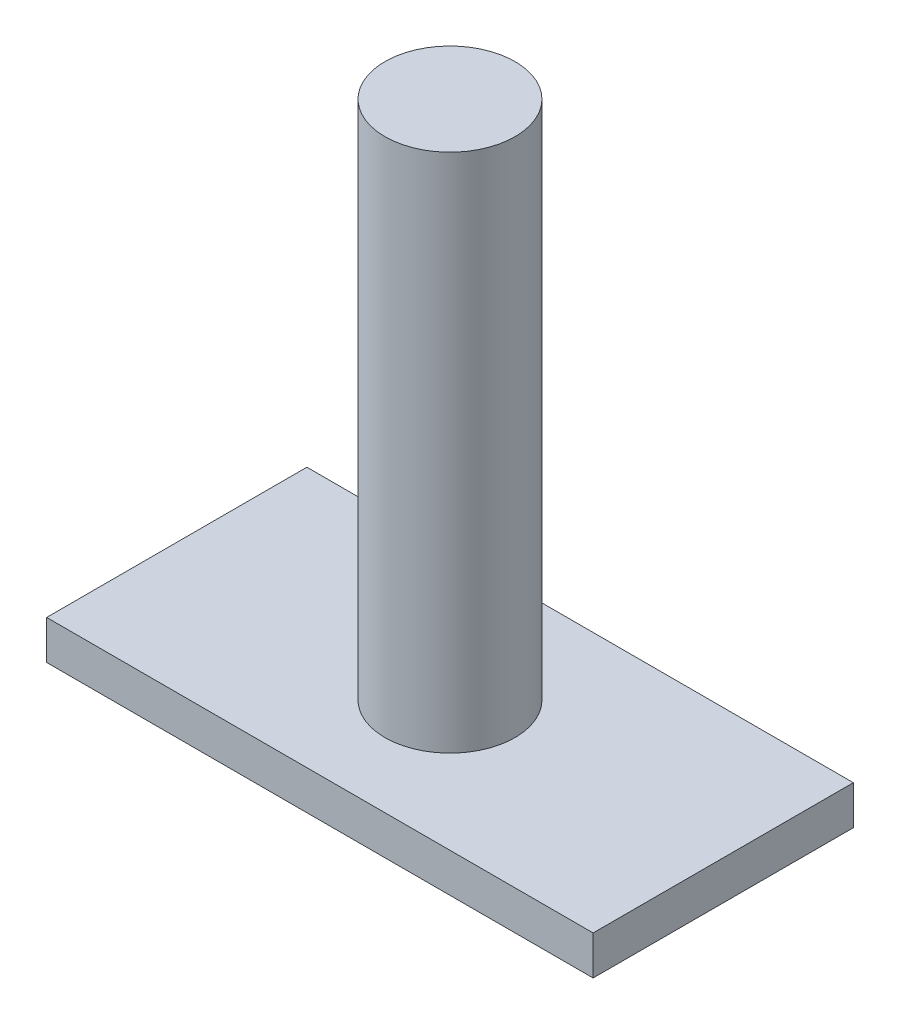
ISO-10303-21;
HEADER;
FILE_DESCRIPTION(('STEP AP214'),'2;1');
FILE_NAME('part.step','',(''),(''),'','','');
FILE_SCHEMA(('AUTOMOTIVE_DESIGN { 1 0 10303 214 1 1 1 1 }'));
ENDSEC;
DATA;
#1=APPLICATION_CONTEXT('core data for automotive mechanical design processes');
#2=APPLICATION_PROTOCOL_DEFINITION('international standard','automotive_design',2000,#1);
#3=PRODUCT_CONTEXT('',#1,'mechanical');
#4=PRODUCT('Part','Part','',(#3));
#5=PRODUCT_RELATED_PRODUCT_CATEGORY('part','',(#4));
#6=PRODUCT_DEFINITION_FORMATION('','',#4);
#7=PRODUCT_DEFINITION_CONTEXT('part definition',#1,'design');
#8=PRODUCT_DEFINITION('design','',#6,#7);
#9=PRODUCT_DEFINITION_SHAPE('','',#8);
#10=(LENGTH_UNIT() NAMED_UNIT(*) SI_UNIT(.MILLI.,.METRE.));
#11=(NAMED_UNIT(*) PLANE_ANGLE_UNIT() SI_UNIT($,.RADIAN.));
#12=(NAMED_UNIT(*) SI_UNIT($,.STERADIAN.) SOLID_ANGLE_UNIT());
#13=UNCERTAINTY_MEASURE_WITH_UNIT(LENGTH_MEASURE(1.E-05),#10,'distance_accuracy_value','');
#14=(GEOMETRIC_REPRESENTATION_CONTEXT(3) GLOBAL_UNCERTAINTY_ASSIGNED_CONTEXT((#13)) GLOBAL_UNIT_ASSIGNED_CONTEXT((#10,
#11,#12)) REPRESENTATION_CONTEXT('',''));
#15=CARTESIAN_POINT('',(0.,0.,0.));
#16=DIRECTION('',(0.,0.,1.));
#17=DIRECTION('',(1.,0.,0.));
#18=AXIS2_PLACEMENT_3D('',#15,#16,#17);
#19=CARTESIAN_POINT('',(0.,3.81,0.));
#20=DIRECTION('',(1.,0.,0.));
#21=DIRECTION('',(0.,0.,-1.));
#22=AXIS2_PLACEMENT_3D('',#19,#20,#21);
#23=PLANE('',#22);
#24=DIRECTION('',(0.,0.,1.));
#25=VECTOR('',#24,1.);
#26=CARTESIAN_POINT('',(0.,0.,0.));
#27=LINE('',#26,#25);
#28=CARTESIAN_POINT('',(0.,0.,-25.4));
#29=VERTEX_POINT('',#28);
#30=CARTESIAN_POINT('',(0.,0.,0.));
#31=VERTEX_POINT('',#30);
#32=EDGE_CURVE('E99',#29,#31,#27,.T.);
#33=ORIENTED_EDGE('',*,*,#32,.T.);
#34=DIRECTION('',(0.,-1.,0.));
#35=VECTOR('',#34,1.);
#36=CARTESIAN_POINT('',(0.,3.81,0.));
#37=LINE('',#36,#35);
#38=CARTESIAN_POINT('',(0.,3.81,0.));
#39=VERTEX_POINT('',#38);
#40=EDGE_CURVE('E36',#39,#31,#37,.T.);
#41=ORIENTED_EDGE('',*,*,#40,.F.);
#42=DIRECTION('',(0.,0.,1.));
#43=VECTOR('',#42,1.);
#44=CARTESIAN_POINT('',(0.,3.81,0.));
#45=LINE('',#44,#43);
#46=CARTESIAN_POINT('',(0.,3.81,-25.4));
#47=VERTEX_POINT('',#46);
#48=EDGE_CURVE('E86',#47,#39,#45,.T.);
#49=ORIENTED_EDGE('',*,*,#48,.F.);
#50=DIRECTION('',(0.,-1.,0.));
#51=VECTOR('',#50,1.);
#52=CARTESIAN_POINT('',(0.,3.81,-25.4));
#53=LINE('',#52,#51);
#54=EDGE_CURVE('E95',#47,#29,#53,.T.);
#55=ORIENTED_EDGE('',*,*,#54,.T.);
#56=EDGE_LOOP('',(#33,#41,#49,#55));
#57=FACE_BOUND('',#56,.T.);
#58=ADVANCED_FACE('F33',(#57),#23,.F.);
#59=CARTESIAN_POINT('',(0.,3.81,0.));
#60=DIRECTION('',(0.,0.,-1.));
#61=DIRECTION('',(-1.,0.,0.));
#62=AXIS2_PLACEMENT_3D('',#59,#60,#61);
#63=PLANE('',#62);
#64=DIRECTION('',(1.,0.,0.));
#65=VECTOR('',#64,1.);
#66=CARTESIAN_POINT('',(0.,0.,0.));
#67=LINE('',#66,#65);
#68=CARTESIAN_POINT('',(53.34,0.,0.));
#69=VERTEX_POINT('',#68);
#70=EDGE_CURVE('E91',#31,#69,#67,.T.);
#71=ORIENTED_EDGE('',*,*,#70,.T.);
#72=DIRECTION('',(0.,-1.,0.));
#73=VECTOR('',#72,1.);
#74=CARTESIAN_POINT('',(53.34,3.81,0.));
#75=LINE('',#74,#73);
#76=CARTESIAN_POINT('',(53.34,3.81,0.));
#77=VERTEX_POINT('',#76);
#78=EDGE_CURVE('E89',#77,#69,#75,.T.);
#79=ORIENTED_EDGE('',*,*,#78,.F.);
#80=DIRECTION('',(1.,0.,0.));
#81=VECTOR('',#80,1.);
#82=CARTESIAN_POINT('',(0.,3.81,0.));
#83=LINE('',#82,#81);
#84=EDGE_CURVE('E81',#39,#77,#83,.T.);
#85=ORIENTED_EDGE('',*,*,#84,.F.);
#86=ORIENTED_EDGE('',*,*,#40,.T.);
#87=EDGE_LOOP('',(#71,#79,#85,#86));
#88=FACE_BOUND('',#87,.T.);
#89=ADVANCED_FACE('F90',(#88),#63,.F.);
#90=CARTESIAN_POINT('',(53.34,3.81,0.));
#91=DIRECTION('',(-1.,0.,0.));
#92=DIRECTION('',(0.,0.,1.));
#93=AXIS2_PLACEMENT_3D('',#90,#91,#92);
#94=PLANE('',#93);
#95=DIRECTION('',(0.,0.,-1.));
#96=VECTOR('',#95,1.);
#97=CARTESIAN_POINT('',(53.34,0.,0.));
#98=LINE('',#97,#96);
#99=CARTESIAN_POINT('',(53.34,0.,-25.4));
#100=VERTEX_POINT('',#99);
#101=EDGE_CURVE('E67',#69,#100,#98,.T.);
#102=ORIENTED_EDGE('',*,*,#101,.T.);
#103=DIRECTION('',(0.,-1.,0.));
#104=VECTOR('',#103,1.);
#105=CARTESIAN_POINT('',(53.34,3.81,-25.4));
#106=LINE('',#105,#104);
#107=CARTESIAN_POINT('',(53.34,3.81,-25.4));
#108=VERTEX_POINT('',#107);
#109=EDGE_CURVE('E92',#108,#100,#106,.T.);
#110=ORIENTED_EDGE('',*,*,#109,.F.);
#111=DIRECTION('',(0.,0.,-1.));
#112=VECTOR('',#111,1.);
#113=CARTESIAN_POINT('',(53.34,3.81,0.));
#114=LINE('',#113,#112);
#115=EDGE_CURVE('E84',#77,#108,#114,.T.);
#116=ORIENTED_EDGE('',*,*,#115,.F.);
#117=ORIENTED_EDGE('',*,*,#78,.T.);
#118=EDGE_LOOP('',(#102,#110,#116,#117));
#119=FACE_BOUND('',#118,.T.);
#120=ADVANCED_FACE('F93',(#119),#94,.F.);
#121=CARTESIAN_POINT('',(0.,3.81,-25.4));
#122=DIRECTION('',(0.,0.,1.));
#123=DIRECTION('',(1.,0.,0.));
#124=AXIS2_PLACEMENT_3D('',#121,#122,#123);
#125=PLANE('',#124);
#126=DIRECTION('',(-1.,0.,0.));
#127=VECTOR('',#126,1.);
#128=CARTESIAN_POINT('',(0.,0.,-25.4));
#129=LINE('',#128,#127);
#130=EDGE_CURVE('E73',#100,#29,#129,.T.);
#131=ORIENTED_EDGE('',*,*,#130,.T.);
#132=ORIENTED_EDGE('',*,*,#54,.F.);
#133=DIRECTION('',(-1.,0.,0.));
#134=VECTOR('',#133,1.);
#135=CARTESIAN_POINT('',(0.,3.81,-25.4));
#136=LINE('',#135,#134);
#137=EDGE_CURVE('E50',#108,#47,#136,.T.);
#138=ORIENTED_EDGE('',*,*,#137,.F.);
#139=ORIENTED_EDGE('',*,*,#109,.T.);
#140=EDGE_LOOP('',(#131,#132,#138,#139));
#141=FACE_BOUND('',#140,.T.);
#142=ADVANCED_FACE('F107',(#141),#125,.F.);
#143=CARTESIAN_POINT('',(0.,3.81,0.));
#144=DIRECTION('',(0.,-1.,0.));
#145=DIRECTION('',(0.,0.,-1.));
#146=AXIS2_PLACEMENT_3D('',#143,#144,#145);
#147=PLANE('',#146);
#148=CARTESIAN_POINT('',(26.67,3.81,-12.7));
#149=DIRECTION('',(0.,1.,0.));
#150=DIRECTION('',(0.,0.,1.));
#151=AXIS2_PLACEMENT_3D('',#148,#149,#150);
#152=CIRCLE('',#151,6.35);
#153=CARTESIAN_POINT('',(26.67,3.81,-6.35));
#154=VERTEX_POINT('',#153);
#155=EDGE_CURVE('E11',#154,#154,#152,.T.);
#156=ORIENTED_EDGE('',*,*,#155,.F.);
#157=EDGE_LOOP('',(#156));
#158=FACE_BOUND('',#157,.T.);
#159=ORIENTED_EDGE('',*,*,#48,.T.);
#160=ORIENTED_EDGE('',*,*,#84,.T.);
#161=ORIENTED_EDGE('',*,*,#115,.T.);
#162=ORIENTED_EDGE('',*,*,#137,.T.);
#163=EDGE_LOOP('',(#159,#160,#161,#162));
#164=FACE_BOUND('',#163,.T.);
#165=ADVANCED_FACE('F82',(#158,#164),#147,.F.);
#166=CARTESIAN_POINT('',(0.,0.,0.));
#167=DIRECTION('',(0.,-1.,0.));
#168=DIRECTION('',(0.,0.,-1.));
#169=AXIS2_PLACEMENT_3D('',#166,#167,#168);
#170=PLANE('',#169);
#171=ORIENTED_EDGE('',*,*,#32,.F.);
#172=ORIENTED_EDGE('',*,*,#130,.F.);
#173=ORIENTED_EDGE('',*,*,#101,.F.);
#174=ORIENTED_EDGE('',*,*,#70,.F.);
#175=EDGE_LOOP('',(#171,#172,#173,#174));
#176=FACE_BOUND('',#175,.T.);
#177=ADVANCED_FACE('F110',(#176),#170,.T.);
#178=CARTESIAN_POINT('',(26.67,54.61,-12.7));
#179=DIRECTION('',(0.,-1.,0.));
#180=DIRECTION('',(0.,0.,-1.));
#181=AXIS2_PLACEMENT_3D('',#178,#179,#180);
#182=CYLINDRICAL_SURFACE('',#181,6.35);
#183=CARTESIAN_POINT('',(26.67,54.61,-12.7));
#184=DIRECTION('',(0.,1.,0.));
#185=DIRECTION('',(0.,0.,1.));
#186=AXIS2_PLACEMENT_3D('',#183,#184,#185);
#187=CIRCLE('',#186,6.35);
#188=CARTESIAN_POINT('',(26.67,54.61,-6.35));
#189=VERTEX_POINT('',#188);
#190=EDGE_CURVE('E102',#189,#189,#187,.T.);
#191=ORIENTED_EDGE('',*,*,#190,.F.);
#192=EDGE_LOOP('',(#191));
#193=FACE_BOUND('',#192,.T.);
#194=ORIENTED_EDGE('',*,*,#155,.T.);
#195=EDGE_LOOP('',(#194));
#196=FACE_BOUND('',#195,.T.);
#197=ADVANCED_FACE('F118',(#193,#196),#182,.T.);
#198=CARTESIAN_POINT('',(26.67,54.61,-12.7));
#199=DIRECTION('',(0.,1.,0.));
#200=DIRECTION('',(0.,0.,1.));
#201=AXIS2_PLACEMENT_3D('',#198,#199,#200);
#202=PLANE('',#201);
#203=ORIENTED_EDGE('',*,*,#190,.T.);
#204=EDGE_LOOP('',(#203));
#205=FACE_BOUND('',#204,.T.);
#206=ADVANCED_FACE('F116',(#205),#202,.T.);
#207=CLOSED_SHELL('',(#58,#89,#120,#142,#165,#177,#197,#206));
#208=MANIFOLD_SOLID_BREP('B2',#207);
#209=ADVANCED_BREP_SHAPE_REPRESENTATION('',(#18,#208),#14);
#210=SHAPE_DEFINITION_REPRESENTATION(#9,#209);
ENDSEC;
END-ISO-10303-21;
